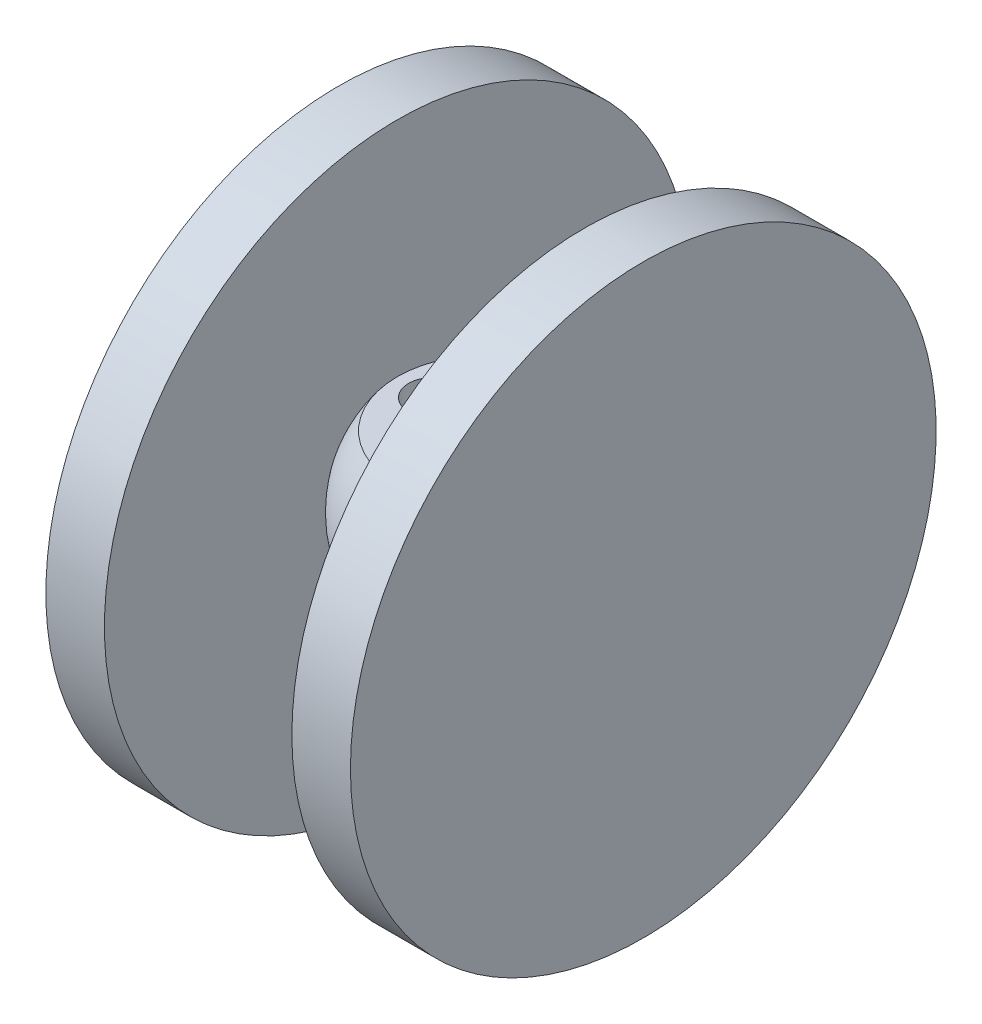
ISO-10303-21;
HEADER;
FILE_DESCRIPTION(('STEP AP214'),'2;1');
FILE_NAME('part.step','',(''),(''),'','','');
FILE_SCHEMA(('AUTOMOTIVE_DESIGN { 1 0 10303 214 1 1 1 1 }'));
ENDSEC;
DATA;
#1=APPLICATION_CONTEXT('core data for automotive mechanical design processes');
#2=APPLICATION_PROTOCOL_DEFINITION('international standard','automotive_design',2000,#1);
#3=PRODUCT_CONTEXT('',#1,'mechanical');
#4=PRODUCT('Part','Part','',(#3));
#5=PRODUCT_RELATED_PRODUCT_CATEGORY('part','',(#4));
#6=PRODUCT_DEFINITION_FORMATION('','',#4);
#7=PRODUCT_DEFINITION_CONTEXT('part definition',#1,'design');
#8=PRODUCT_DEFINITION('design','',#6,#7);
#9=PRODUCT_DEFINITION_SHAPE('','',#8);
#10=(LENGTH_UNIT() NAMED_UNIT(*) SI_UNIT(.MILLI.,.METRE.));
#11=(NAMED_UNIT(*) PLANE_ANGLE_UNIT() SI_UNIT($,.RADIAN.));
#12=(NAMED_UNIT(*) SI_UNIT($,.STERADIAN.) SOLID_ANGLE_UNIT());
#13=UNCERTAINTY_MEASURE_WITH_UNIT(LENGTH_MEASURE(1.E-05),#10,'distance_accuracy_value','');
#14=(GEOMETRIC_REPRESENTATION_CONTEXT(3) GLOBAL_UNCERTAINTY_ASSIGNED_CONTEXT((#13)) GLOBAL_UNIT_ASSIGNED_CONTEXT((#10,
#11,#12)) REPRESENTATION_CONTEXT('',''));
#15=CARTESIAN_POINT('',(0.,0.,0.));
#16=DIRECTION('',(0.,0.,1.));
#17=DIRECTION('',(1.,0.,0.));
#18=AXIS2_PLACEMENT_3D('',#15,#16,#17);
#19=CARTESIAN_POINT('',(0.,0.,0.));
#20=DIRECTION('',(0.,-1.,0.));
#21=DIRECTION('',(0.,0.,1.));
#22=AXIS2_PLACEMENT_3D('',#19,#20,#21);
#23=SPHERICAL_SURFACE('',#22,20.);
#24=CARTESIAN_POINT('',(0.,0.,-20.));
#25=VERTEX_POINT('',#24);
#26=VERTEX_LOOP('',#25);
#27=FACE_BOUND('',#26,.T.);
#28=CARTESIAN_POINT('',(0.,0.,20.));
#29=VERTEX_POINT('',#28);
#30=VERTEX_LOOP('',#29);
#31=FACE_BOUND('',#30,.T.);
#32=CARTESIAN_POINT('',(0.,12.,0.));
#33=DIRECTION('',(0.,-1.,0.));
#34=DIRECTION('',(0.,0.,-1.));
#35=AXIS2_PLACEMENT_3D('',#32,#33,#34);
#36=CIRCLE('',#35,16.);
#37=CARTESIAN_POINT('',(16.,12.,0.));
#38=VERTEX_POINT('',#37);
#39=CARTESIAN_POINT('',(-16.,12.,0.));
#40=VERTEX_POINT('',#39);
#41=EDGE_CURVE('E85',#38,#40,#36,.T.);
#42=ORIENTED_EDGE('',*,*,#41,.T.);
#43=CARTESIAN_POINT('',(-16.,0.,0.));
#44=DIRECTION('',(1.,0.,0.));
#45=DIRECTION('',(0.,0.,-1.));
#46=AXIS2_PLACEMENT_3D('',#43,#44,#45);
#47=CIRCLE('',#46,12.);
#48=EDGE_CURVE('E81',#40,#40,#47,.F.);
#49=ORIENTED_EDGE('',*,*,#48,.F.);
#50=EDGE_CURVE('E88',#40,#38,#36,.T.);
#51=ORIENTED_EDGE('',*,*,#50,.T.);
#52=CARTESIAN_POINT('',(16.,0.,0.));
#53=DIRECTION('',(-1.,0.,0.));
#54=DIRECTION('',(0.,0.,1.));
#55=AXIS2_PLACEMENT_3D('',#52,#53,#54);
#56=CIRCLE('',#55,12.);
#57=EDGE_CURVE('E63',#38,#38,#56,.F.);
#58=ORIENTED_EDGE('',*,*,#57,.F.);
#59=EDGE_LOOP('',(#42,#49,#51,#58));
#60=FACE_BOUND('',#59,.T.);
#61=ADVANCED_FACE('F40',(#27,#31,#60),#23,.T.);
#62=CARTESIAN_POINT('',(0.,12.,0.));
#63=DIRECTION('',(0.,1.,0.));
#64=DIRECTION('',(0.,0.,1.));
#65=AXIS2_PLACEMENT_3D('',#62,#63,#64);
#66=PLANE('',#65);
#67=CARTESIAN_POINT('',(-9.76511059657765,12.,0.));
#68=DIRECTION('',(0.,1.,0.));
#69=DIRECTION('',(1.,0.,0.));
#70=AXIS2_PLACEMENT_3D('',#67,#68,#69);
#71=ELLIPSE('',#70,4.29176718320413,4.25);
#72=CARTESIAN_POINT('',(-5.47334341337352,12.,0.));
#73=VERTEX_POINT('',#72);
#74=EDGE_CURVE('E84',#73,#73,#71,.F.);
#75=ORIENTED_EDGE('',*,*,#74,.T.);
#76=EDGE_LOOP('',(#75));
#77=FACE_BOUND('',#76,.T.);
#78=CARTESIAN_POINT('',(9.76511059657765,12.,0.));
#79=DIRECTION('',(0.,1.,0.));
#80=DIRECTION('',(-1.,0.,0.));
#81=AXIS2_PLACEMENT_3D('',#78,#79,#80);
#82=ELLIPSE('',#81,4.29176718320413,4.25);
#83=CARTESIAN_POINT('',(5.47334341337352,12.,0.));
#84=VERTEX_POINT('',#83);
#85=EDGE_CURVE('E89',#84,#84,#82,.F.);
#86=ORIENTED_EDGE('',*,*,#85,.T.);
#87=EDGE_LOOP('',(#86));
#88=FACE_BOUND('',#87,.T.);
#89=ORIENTED_EDGE('',*,*,#41,.F.);
#90=ORIENTED_EDGE('',*,*,#50,.F.);
#91=EDGE_LOOP('',(#89,#90));
#92=FACE_BOUND('',#91,.T.);
#93=ADVANCED_FACE('F118',(#77,#88,#92),#66,.T.);
#94=CARTESIAN_POINT('',(9.96335172545137,13.4105589261194,0.));
#95=DIRECTION('',(-0.139173100960066,-0.99026806874157,0.));
#96=DIRECTION('',(0.99026806874157,-0.139173100960066,0.));
#97=AXIS2_PLACEMENT_3D('',#94,#95,#96);
#98=CYLINDRICAL_SURFACE('',#97,4.25);
#99=CARTESIAN_POINT('',(7.92214454993797,-1.11338480764207,0.));
#100=DIRECTION('',(0.139173100960066,0.99026806874157,0.));
#101=DIRECTION('',(-0.99026806874157,0.139173100960066,0.));
#102=AXIS2_PLACEMENT_3D('',#99,#100,#101);
#103=CIRCLE('',#102,4.25);
#104=CARTESIAN_POINT('',(3.71350525778629,-0.521899128561795,0.));
#105=VERTEX_POINT('',#104);
#106=EDGE_CURVE('E96',#105,#105,#103,.F.);
#107=ORIENTED_EDGE('',*,*,#106,.T.);
#108=EDGE_LOOP('',(#107));
#109=FACE_BOUND('',#108,.T.);
#110=ORIENTED_EDGE('',*,*,#85,.F.);
#111=EDGE_LOOP('',(#110));
#112=FACE_BOUND('',#111,.T.);
#113=ADVANCED_FACE('F123',(#109,#112),#98,.F.);
#114=CARTESIAN_POINT('',(6.5304135403319,-11.0160654950962,0.));
#115=DIRECTION('',(0.139173100960066,0.99026806874157,0.));
#116=DIRECTION('',(-0.99026806874157,0.139173100960066,0.));
#117=AXIS2_PLACEMENT_3D('',#114,#115,#116);
#118=PLANE('',#117);
#119=CARTESIAN_POINT('',(6.5304135403319,-11.0160654950962,0.));
#120=DIRECTION('',(0.139173100960066,0.99026806874157,0.));
#121=DIRECTION('',(-0.99026806874157,0.139173100960066,0.));
#122=AXIS2_PLACEMENT_3D('',#119,#120,#121);
#123=CIRCLE('',#122,4.07544935071713);
#124=CARTESIAN_POINT('',(2.49462618254317,-10.4488725711512,0.));
#125=VERTEX_POINT('',#124);
#126=EDGE_CURVE('E87',#125,#125,#123,.T.);
#127=ORIENTED_EDGE('',*,*,#126,.T.);
#128=EDGE_LOOP('',(#127));
#129=FACE_BOUND('',#128,.T.);
#130=ADVANCED_FACE('F134',(#129),#118,.T.);
#131=CARTESIAN_POINT('',(-9.96335172545137,13.4105589261194,0.));
#132=DIRECTION('',(0.139173100960066,-0.99026806874157,0.));
#133=DIRECTION('',(0.99026806874157,0.139173100960066,0.));
#134=AXIS2_PLACEMENT_3D('',#131,#132,#133);
#135=CYLINDRICAL_SURFACE('',#134,4.25);
#136=CARTESIAN_POINT('',(-7.92214454993135,-1.11338480768913,0.));
#137=DIRECTION('',(-0.139173100960066,0.99026806874157,0.));
#138=DIRECTION('',(-0.99026806874157,-0.139173100960066,0.));
#139=AXIS2_PLACEMENT_3D('',#136,#137,#138);
#140=CIRCLE('',#139,4.25);
#141=CARTESIAN_POINT('',(-12.130783842083,-1.70487048676941,0.));
#142=VERTEX_POINT('',#141);
#143=EDGE_CURVE('E12',#142,#142,#140,.F.);
#144=ORIENTED_EDGE('',*,*,#143,.T.);
#145=EDGE_LOOP('',(#144));
#146=FACE_BOUND('',#145,.T.);
#147=ORIENTED_EDGE('',*,*,#74,.F.);
#148=EDGE_LOOP('',(#147));
#149=FACE_BOUND('',#148,.T.);
#150=ADVANCED_FACE('F138',(#146,#149),#135,.F.);
#151=CARTESIAN_POINT('',(-6.5304135403319,-11.0160654950962,0.));
#152=DIRECTION('',(-0.139173100960066,0.99026806874157,0.));
#153=DIRECTION('',(-0.99026806874157,-0.139173100960066,0.));
#154=AXIS2_PLACEMENT_3D('',#151,#152,#153);
#155=PLANE('',#154);
#156=CARTESIAN_POINT('',(-6.5304135403319,-11.0160654950962,0.));
#157=DIRECTION('',(-0.139173100960066,0.99026806874157,0.));
#158=DIRECTION('',(-0.99026806874157,-0.139173100960066,0.));
#159=AXIS2_PLACEMENT_3D('',#156,#157,#158);
#160=CIRCLE('',#159,4.07544935071794);
#161=CARTESIAN_POINT('',(-10.5662008981214,-11.5832584190413,0.));
#162=VERTEX_POINT('',#161);
#163=EDGE_CURVE('E49',#162,#162,#160,.T.);
#164=ORIENTED_EDGE('',*,*,#163,.T.);
#165=EDGE_LOOP('',(#164));
#166=FACE_BOUND('',#165,.T.);
#167=ADVANCED_FACE('F101',(#166),#155,.T.);
#168=CARTESIAN_POINT('',(6.5304135403319,-11.0160654950962,0.));
#169=DIRECTION('',(0.139173100960066,0.99026806874157,0.));
#170=DIRECTION('',(-0.99026806874157,0.139173100960066,0.));
#171=AXIS2_PLACEMENT_3D('',#168,#169,#170);
#172=CONICAL_SURFACE('',#171,4.07544935071713,0.0174532925199451);
#173=ORIENTED_EDGE('',*,*,#106,.F.);
#174=EDGE_LOOP('',(#173));
#175=FACE_BOUND('',#174,.T.);
#176=ORIENTED_EDGE('',*,*,#126,.F.);
#177=EDGE_LOOP('',(#176));
#178=FACE_BOUND('',#177,.T.);
#179=ADVANCED_FACE('F105',(#175,#178),#172,.F.);
#180=CARTESIAN_POINT('',(-6.5304135403319,-11.0160654950962,0.));
#181=DIRECTION('',(-0.139173100960066,0.99026806874157,0.));
#182=DIRECTION('',(-0.99026806874157,-0.139173100960066,0.));
#183=AXIS2_PLACEMENT_3D('',#180,#181,#182);
#184=CONICAL_SURFACE('',#183,4.07544935071794,0.0174532925199467);
#185=ORIENTED_EDGE('',*,*,#143,.F.);
#186=EDGE_LOOP('',(#185));
#187=FACE_BOUND('',#186,.T.);
#188=ORIENTED_EDGE('',*,*,#163,.F.);
#189=EDGE_LOOP('',(#188));
#190=FACE_BOUND('',#189,.T.);
#191=ADVANCED_FACE('F43',(#187,#190),#184,.F.);
#192=CARTESIAN_POINT('',(-26.,0.,0.));
#193=DIRECTION('',(1.,0.,0.));
#194=DIRECTION('',(0.,0.,-1.));
#195=AXIS2_PLACEMENT_3D('',#192,#193,#194);
#196=CYLINDRICAL_SURFACE('',#195,50.);
#197=CARTESIAN_POINT('',(-26.,0.,0.));
#198=DIRECTION('',(1.,0.,0.));
#199=DIRECTION('',(0.,0.,-1.));
#200=AXIS2_PLACEMENT_3D('',#197,#198,#199);
#201=CIRCLE('',#200,50.);
#202=CARTESIAN_POINT('',(-26.,0.,-50.));
#203=VERTEX_POINT('',#202);
#204=EDGE_CURVE('E73',#203,#203,#201,.T.);
#205=ORIENTED_EDGE('',*,*,#204,.T.);
#206=EDGE_LOOP('',(#205));
#207=FACE_BOUND('',#206,.T.);
#208=CARTESIAN_POINT('',(-16.,0.,0.));
#209=DIRECTION('',(1.,0.,0.));
#210=DIRECTION('',(0.,0.,-1.));
#211=AXIS2_PLACEMENT_3D('',#208,#209,#210);
#212=CIRCLE('',#211,50.);
#213=CARTESIAN_POINT('',(-16.,0.,-50.));
#214=VERTEX_POINT('',#213);
#215=EDGE_CURVE('E69',#214,#214,#212,.T.);
#216=ORIENTED_EDGE('',*,*,#215,.F.);
#217=EDGE_LOOP('',(#216));
#218=FACE_BOUND('',#217,.T.);
#219=ADVANCED_FACE('F104',(#207,#218),#196,.T.);
#220=CARTESIAN_POINT('',(-26.,0.,0.));
#221=DIRECTION('',(1.,0.,0.));
#222=DIRECTION('',(0.,0.,-1.));
#223=AXIS2_PLACEMENT_3D('',#220,#221,#222);
#224=PLANE('',#223);
#225=ORIENTED_EDGE('',*,*,#204,.F.);
#226=EDGE_LOOP('',(#225));
#227=FACE_BOUND('',#226,.T.);
#228=ADVANCED_FACE('F112',(#227),#224,.F.);
#229=CARTESIAN_POINT('',(-16.,0.,0.));
#230=DIRECTION('',(1.,0.,0.));
#231=DIRECTION('',(0.,0.,-1.));
#232=AXIS2_PLACEMENT_3D('',#229,#230,#231);
#233=PLANE('',#232);
#234=ORIENTED_EDGE('',*,*,#48,.T.);
#235=EDGE_LOOP('',(#234));
#236=FACE_BOUND('',#235,.T.);
#237=ORIENTED_EDGE('',*,*,#215,.T.);
#238=EDGE_LOOP('',(#237));
#239=FACE_BOUND('',#238,.T.);
#240=ADVANCED_FACE('F145',(#236,#239),#233,.T.);
#241=CARTESIAN_POINT('',(26.,0.,0.));
#242=DIRECTION('',(-1.,0.,0.));
#243=DIRECTION('',(0.,0.,1.));
#244=AXIS2_PLACEMENT_3D('',#241,#242,#243);
#245=CYLINDRICAL_SURFACE('',#244,50.);
#246=CARTESIAN_POINT('',(26.,0.,0.));
#247=DIRECTION('',(-1.,0.,0.));
#248=DIRECTION('',(0.,0.,1.));
#249=AXIS2_PLACEMENT_3D('',#246,#247,#248);
#250=CIRCLE('',#249,50.);
#251=CARTESIAN_POINT('',(26.,0.,50.));
#252=VERTEX_POINT('',#251);
#253=EDGE_CURVE('E70',#252,#252,#250,.T.);
#254=ORIENTED_EDGE('',*,*,#253,.T.);
#255=EDGE_LOOP('',(#254));
#256=FACE_BOUND('',#255,.T.);
#257=CARTESIAN_POINT('',(16.,0.,0.));
#258=DIRECTION('',(-1.,0.,0.));
#259=DIRECTION('',(0.,0.,1.));
#260=AXIS2_PLACEMENT_3D('',#257,#258,#259);
#261=CIRCLE('',#260,50.);
#262=CARTESIAN_POINT('',(16.,0.,50.));
#263=VERTEX_POINT('',#262);
#264=EDGE_CURVE('E76',#263,#263,#261,.T.);
#265=ORIENTED_EDGE('',*,*,#264,.F.);
#266=EDGE_LOOP('',(#265));
#267=FACE_BOUND('',#266,.T.);
#268=ADVANCED_FACE('F148',(#256,#267),#245,.T.);
#269=CARTESIAN_POINT('',(26.,0.,0.));
#270=DIRECTION('',(-1.,0.,0.));
#271=DIRECTION('',(0.,0.,1.));
#272=AXIS2_PLACEMENT_3D('',#269,#270,#271);
#273=PLANE('',#272);
#274=ORIENTED_EDGE('',*,*,#253,.F.);
#275=EDGE_LOOP('',(#274));
#276=FACE_BOUND('',#275,.T.);
#277=ADVANCED_FACE('F155',(#276),#273,.F.);
#278=CARTESIAN_POINT('',(16.,0.,0.));
#279=DIRECTION('',(-1.,0.,0.));
#280=DIRECTION('',(0.,0.,1.));
#281=AXIS2_PLACEMENT_3D('',#278,#279,#280);
#282=PLANE('',#281);
#283=ORIENTED_EDGE('',*,*,#57,.T.);
#284=EDGE_LOOP('',(#283));
#285=FACE_BOUND('',#284,.T.);
#286=ORIENTED_EDGE('',*,*,#264,.T.);
#287=EDGE_LOOP('',(#286));
#288=FACE_BOUND('',#287,.T.);
#289=ADVANCED_FACE('F64',(#285,#288),#282,.T.);
#290=CLOSED_SHELL('',(#61,#93,#113,#130,#150,#167,#179,#191,#219,#228,#240,#268,#277,#289));
#291=MANIFOLD_SOLID_BREP('B2',#290);
#292=ADVANCED_BREP_SHAPE_REPRESENTATION('',(#18,#291),#14);
#293=SHAPE_DEFINITION_REPRESENTATION(#9,#292);
ENDSEC;
END-ISO-10303-21;
